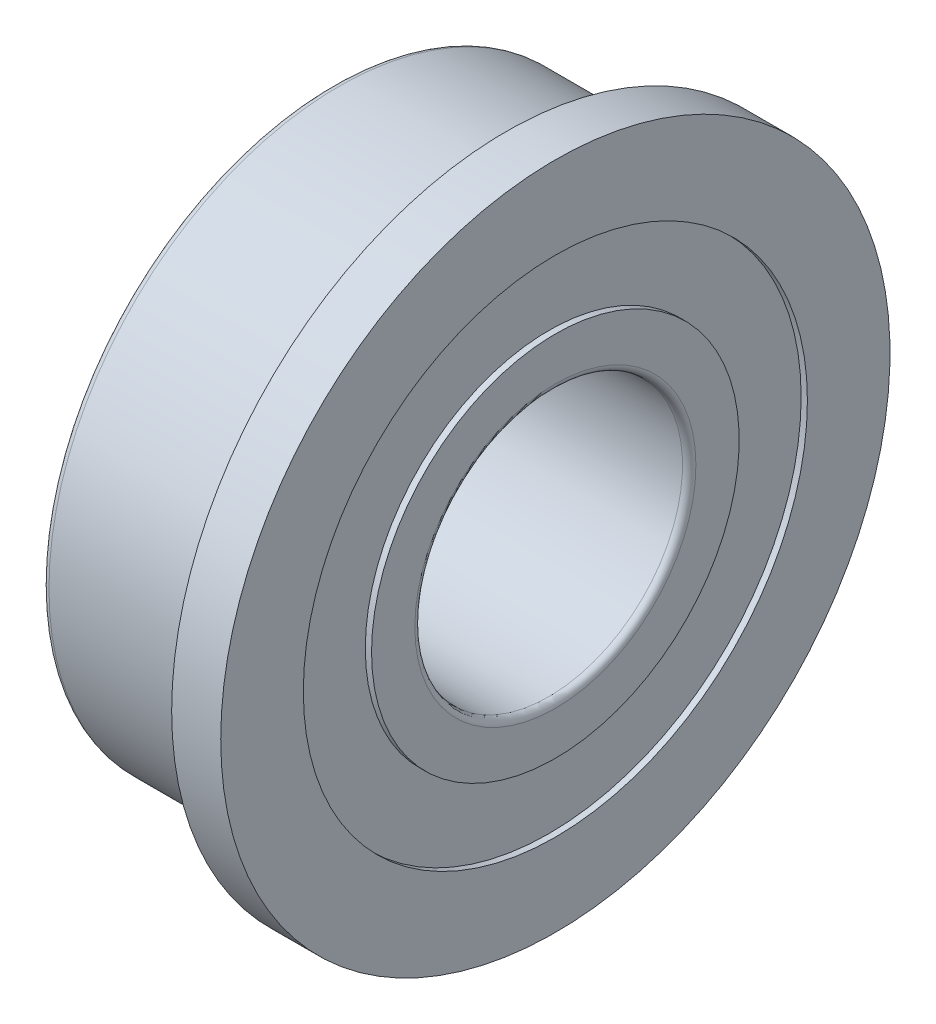
ISO-10303-21;
HEADER;
FILE_DESCRIPTION(('STEP AP214'),'2;1');
FILE_NAME('part.step','',(''),(''),'','','');
FILE_SCHEMA(('AUTOMOTIVE_DESIGN { 1 0 10303 214 1 1 1 1 }'));
ENDSEC;
DATA;
#1=APPLICATION_CONTEXT('core data for automotive mechanical design processes');
#2=APPLICATION_PROTOCOL_DEFINITION('international standard','automotive_design',2000,#1);
#3=PRODUCT_CONTEXT('',#1,'mechanical');
#4=PRODUCT('Part','Part','',(#3));
#5=PRODUCT_RELATED_PRODUCT_CATEGORY('part','',(#4));
#6=PRODUCT_DEFINITION_FORMATION('','',#4);
#7=PRODUCT_DEFINITION_CONTEXT('part definition',#1,'design');
#8=PRODUCT_DEFINITION('design','',#6,#7);
#9=PRODUCT_DEFINITION_SHAPE('','',#8);
#10=(LENGTH_UNIT() NAMED_UNIT(*) SI_UNIT(.MILLI.,.METRE.));
#11=(NAMED_UNIT(*) PLANE_ANGLE_UNIT() SI_UNIT($,.RADIAN.));
#12=(NAMED_UNIT(*) SI_UNIT($,.STERADIAN.) SOLID_ANGLE_UNIT());
#13=UNCERTAINTY_MEASURE_WITH_UNIT(LENGTH_MEASURE(1.E-05),#10,'distance_accuracy_value','');
#14=(GEOMETRIC_REPRESENTATION_CONTEXT(3) GLOBAL_UNCERTAINTY_ASSIGNED_CONTEXT((#13)) GLOBAL_UNIT_ASSIGNED_CONTEXT((#10,
#11,#12)) REPRESENTATION_CONTEXT('',''));
#15=CARTESIAN_POINT('',(0.,0.,0.));
#16=DIRECTION('',(0.,0.,1.));
#17=DIRECTION('',(1.,0.,0.));
#18=AXIS2_PLACEMENT_3D('',#15,#16,#17);
#19=CARTESIAN_POINT('',(0.,-4.12000000000003,-4.12000000000001));
#20=DIRECTION('',(-1.,0.,0.));
#21=DIRECTION('',(0.,0.,1.));
#22=AXIS2_PLACEMENT_3D('',#19,#20,#21);
#23=PLANE('',#22);
#24=CARTESIAN_POINT('',(0.,0.,0.));
#25=DIRECTION('',(-1.,0.,0.));
#26=DIRECTION('',(0.,0.,-1.));
#27=AXIS2_PLACEMENT_3D('',#24,#25,#26);
#28=CIRCLE('',#27,4.12);
#29=CARTESIAN_POINT('',(0.,0.,-4.12));
#30=VERTEX_POINT('',#29);
#31=EDGE_CURVE('E74',#30,#30,#28,.F.);
#32=ORIENTED_EDGE('',*,*,#31,.F.);
#33=EDGE_LOOP('',(#32));
#34=FACE_BOUND('',#33,.T.);
#35=CARTESIAN_POINT('',(0.,0.,0.));
#36=DIRECTION('',(1.,0.,0.));
#37=DIRECTION('',(0.,0.,1.));
#38=AXIS2_PLACEMENT_3D('',#35,#36,#37);
#39=CIRCLE('',#38,3.15);
#40=CARTESIAN_POINT('',(0.,0.,3.15));
#41=VERTEX_POINT('',#40);
#42=EDGE_CURVE('E71',#41,#41,#39,.T.);
#43=ORIENTED_EDGE('',*,*,#42,.T.);
#44=EDGE_LOOP('',(#43));
#45=FACE_BOUND('',#44,.T.);
#46=ADVANCED_FACE('F15',(#34,#45),#23,.T.);
#47=CARTESIAN_POINT('',(5.,-4.12000000000003,4.1200003159894));
#48=DIRECTION('',(1.,0.,0.));
#49=DIRECTION('',(0.,0.,-1.));
#50=AXIS2_PLACEMENT_3D('',#47,#48,#49);
#51=PLANE('',#50);
#52=CARTESIAN_POINT('',(5.,0.,0.));
#53=DIRECTION('',(1.,0.,0.));
#54=DIRECTION('',(0.,1.41914849882362E-07,0.99999999999999));
#55=AXIS2_PLACEMENT_3D('',#52,#53,#54);
#56=CIRCLE('',#55,4.12);
#57=CARTESIAN_POINT('',(5.,5.84689181515333E-07,4.11999999999996));
#58=VERTEX_POINT('',#57);
#59=EDGE_CURVE('E68',#58,#58,#56,.T.);
#60=ORIENTED_EDGE('',*,*,#59,.T.);
#61=EDGE_LOOP('',(#60));
#62=FACE_BOUND('',#61,.T.);
#63=CARTESIAN_POINT('',(5.,0.,0.));
#64=DIRECTION('',(-1.,0.,0.));
#65=DIRECTION('',(0.,0.,-1.));
#66=AXIS2_PLACEMENT_3D('',#63,#64,#65);
#67=CIRCLE('',#66,3.15);
#68=CARTESIAN_POINT('',(5.,0.,-3.15));
#69=VERTEX_POINT('',#68);
#70=EDGE_CURVE('E65',#69,#69,#67,.F.);
#71=ORIENTED_EDGE('',*,*,#70,.F.);
#72=EDGE_LOOP('',(#71));
#73=FACE_BOUND('',#72,.T.);
#74=ADVANCED_FACE('F82',(#62,#73),#51,.T.);
#75=CARTESIAN_POINT('',(4.86,-5.649,5.649));
#76=DIRECTION('',(1.,0.,0.));
#77=DIRECTION('',(0.,0.,-1.));
#78=AXIS2_PLACEMENT_3D('',#75,#76,#77);
#79=PLANE('',#78);
#80=CARTESIAN_POINT('',(4.86,0.,0.));
#81=DIRECTION('',(1.,0.,0.));
#82=DIRECTION('',(0.,-1.16839973309458E-09,1.));
#83=AXIS2_PLACEMENT_3D('',#80,#81,#82);
#84=CIRCLE('',#83,5.649);
#85=CARTESIAN_POINT('',(4.86,-6.60029009225127E-09,5.649));
#86=VERTEX_POINT('',#85);
#87=EDGE_CURVE('E62',#86,#86,#84,.T.);
#88=ORIENTED_EDGE('',*,*,#87,.T.);
#89=EDGE_LOOP('',(#88));
#90=FACE_BOUND('',#89,.T.);
#91=CARTESIAN_POINT('',(4.86,0.,0.));
#92=DIRECTION('',(-1.,0.,0.));
#93=DIRECTION('',(0.,0.,-1.));
#94=AXIS2_PLACEMENT_3D('',#91,#92,#93);
#95=CIRCLE('',#94,4.12);
#96=CARTESIAN_POINT('',(4.86,0.,-4.12));
#97=VERTEX_POINT('',#96);
#98=EDGE_CURVE('E59',#97,#97,#95,.F.);
#99=ORIENTED_EDGE('',*,*,#98,.F.);
#100=EDGE_LOOP('',(#99));
#101=FACE_BOUND('',#100,.T.);
#102=ADVANCED_FACE('F153',(#90,#101),#79,.T.);
#103=CARTESIAN_POINT('',(5.,-7.70492968244106,7.5));
#104=DIRECTION('',(1.,0.,0.));
#105=DIRECTION('',(0.,0.,-1.));
#106=AXIS2_PLACEMENT_3D('',#103,#104,#105);
#107=PLANE('',#106);
#108=CARTESIAN_POINT('',(5.,0.,0.));
#109=DIRECTION('',(1.,0.,0.));
#110=DIRECTION('',(0.,0.,1.));
#111=AXIS2_PLACEMENT_3D('',#108,#109,#110);
#112=CIRCLE('',#111,7.5);
#113=CARTESIAN_POINT('',(5.,0.,7.5));
#114=VERTEX_POINT('',#113);
#115=EDGE_CURVE('E56',#114,#114,#112,.T.);
#116=ORIENTED_EDGE('',*,*,#115,.T.);
#117=EDGE_LOOP('',(#116));
#118=FACE_BOUND('',#117,.T.);
#119=CARTESIAN_POINT('',(5.,0.,0.));
#120=DIRECTION('',(-1.,0.,0.));
#121=DIRECTION('',(0.,0.,-1.));
#122=AXIS2_PLACEMENT_3D('',#119,#120,#121);
#123=CIRCLE('',#122,5.649);
#124=CARTESIAN_POINT('',(5.,0.,-5.649));
#125=VERTEX_POINT('',#124);
#126=EDGE_CURVE('E53',#125,#125,#123,.F.);
#127=ORIENTED_EDGE('',*,*,#126,.F.);
#128=EDGE_LOOP('',(#127));
#129=FACE_BOUND('',#128,.T.);
#130=ADVANCED_FACE('F146',(#118,#129),#107,.T.);
#131=CARTESIAN_POINT('',(3.9,-7.70492968244106,-7.5));
#132=DIRECTION('',(-1.,0.,0.));
#133=DIRECTION('',(0.,0.,1.));
#134=AXIS2_PLACEMENT_3D('',#131,#132,#133);
#135=PLANE('',#134);
#136=CARTESIAN_POINT('',(3.9,0.,0.));
#137=DIRECTION('',(-1.,0.,0.));
#138=DIRECTION('',(0.,0.,-1.));
#139=AXIS2_PLACEMENT_3D('',#136,#137,#138);
#140=CIRCLE('',#139,7.5);
#141=CARTESIAN_POINT('',(3.9,0.,-7.5));
#142=VERTEX_POINT('',#141);
#143=EDGE_CURVE('E50',#142,#142,#140,.F.);
#144=ORIENTED_EDGE('',*,*,#143,.F.);
#145=EDGE_LOOP('',(#144));
#146=FACE_BOUND('',#145,.T.);
#147=CARTESIAN_POINT('',(3.9,0.,0.));
#148=DIRECTION('',(1.,0.,0.));
#149=DIRECTION('',(0.,-1.16857327490417E-09,1.));
#150=AXIS2_PLACEMENT_3D('',#147,#148,#149);
#151=CIRCLE('',#150,6.65000000000001);
#152=CARTESIAN_POINT('',(3.9,-7.77101227811273E-09,6.65000000000001));
#153=VERTEX_POINT('',#152);
#154=EDGE_CURVE('E47',#153,#153,#151,.T.);
#155=ORIENTED_EDGE('',*,*,#154,.T.);
#156=EDGE_LOOP('',(#155));
#157=FACE_BOUND('',#156,.T.);
#158=ADVANCED_FACE('F141',(#146,#157),#135,.T.);
#159=CARTESIAN_POINT('',(0.,-6.52350713113343,-6.35));
#160=DIRECTION('',(-1.,0.,0.));
#161=DIRECTION('',(0.,0.,1.));
#162=AXIS2_PLACEMENT_3D('',#159,#160,#161);
#163=PLANE('',#162);
#164=CARTESIAN_POINT('',(0.,0.,0.));
#165=DIRECTION('',(-1.,0.,0.));
#166=DIRECTION('',(0.,0.,-1.));
#167=AXIS2_PLACEMENT_3D('',#164,#165,#166);
#168=CIRCLE('',#167,6.35);
#169=CARTESIAN_POINT('',(0.,0.,-6.35));
#170=VERTEX_POINT('',#169);
#171=EDGE_CURVE('E44',#170,#170,#168,.F.);
#172=ORIENTED_EDGE('',*,*,#171,.F.);
#173=EDGE_LOOP('',(#172));
#174=FACE_BOUND('',#173,.T.);
#175=CARTESIAN_POINT('',(0.,0.,0.));
#176=DIRECTION('',(1.,0.,0.));
#177=DIRECTION('',(0.,-1.16839989032213E-09,1.));
#178=AXIS2_PLACEMENT_3D('',#175,#176,#177);
#179=CIRCLE('',#178,5.649);
#180=CARTESIAN_POINT('',(0.,-6.60029098042969E-09,5.649));
#181=VERTEX_POINT('',#180);
#182=EDGE_CURVE('E41',#181,#181,#179,.T.);
#183=ORIENTED_EDGE('',*,*,#182,.T.);
#184=EDGE_LOOP('',(#183));
#185=FACE_BOUND('',#184,.T.);
#186=ADVANCED_FACE('F100',(#174,#185),#163,.T.);
#187=CARTESIAN_POINT('',(0.14,-5.649,-5.649));
#188=DIRECTION('',(-1.,0.,0.));
#189=DIRECTION('',(0.,0.,1.));
#190=AXIS2_PLACEMENT_3D('',#187,#188,#189);
#191=PLANE('',#190);
#192=CARTESIAN_POINT('',(0.14,0.,0.));
#193=DIRECTION('',(-1.,0.,0.));
#194=DIRECTION('',(0.,0.,-1.));
#195=AXIS2_PLACEMENT_3D('',#192,#193,#194);
#196=CIRCLE('',#195,5.649);
#197=CARTESIAN_POINT('',(0.14,0.,-5.649));
#198=VERTEX_POINT('',#197);
#199=EDGE_CURVE('E38',#198,#198,#196,.F.);
#200=ORIENTED_EDGE('',*,*,#199,.F.);
#201=EDGE_LOOP('',(#200));
#202=FACE_BOUND('',#201,.T.);
#203=CARTESIAN_POINT('',(0.14,0.,0.));
#204=DIRECTION('',(1.,0.,0.));
#205=DIRECTION('',(0.,0.,1.));
#206=AXIS2_PLACEMENT_3D('',#203,#204,#205);
#207=CIRCLE('',#206,4.12);
#208=CARTESIAN_POINT('',(0.14,0.,4.12));
#209=VERTEX_POINT('',#208);
#210=EDGE_CURVE('E35',#209,#209,#207,.T.);
#211=ORIENTED_EDGE('',*,*,#210,.T.);
#212=EDGE_LOOP('',(#211));
#213=FACE_BOUND('',#212,.T.);
#214=ADVANCED_FACE('F89',(#202,#213),#191,.T.);
#215=CARTESIAN_POINT('',(0.149999999999969,0.,0.));
#216=DIRECTION('',(1.,0.,0.));
#217=DIRECTION('',(0.,0.,1.));
#218=AXIS2_PLACEMENT_3D('',#215,#216,#217);
#219=TOROIDAL_SURFACE('',#218,3.15,0.149999999999969);
#220=CARTESIAN_POINT('',(0.15,0.,0.));
#221=DIRECTION('',(1.,0.,0.));
#222=DIRECTION('',(0.,0.,1.));
#223=AXIS2_PLACEMENT_3D('',#220,#221,#222);
#224=CIRCLE('',#223,3.00000000000003);
#225=CARTESIAN_POINT('',(0.15,0.,3.00000000000003));
#226=VERTEX_POINT('',#225);
#227=EDGE_CURVE('E30',#226,#226,#224,.T.);
#228=ORIENTED_EDGE('',*,*,#227,.T.);
#229=EDGE_LOOP('',(#228));
#230=FACE_BOUND('',#229,.T.);
#231=ORIENTED_EDGE('',*,*,#42,.F.);
#232=EDGE_LOOP('',(#231));
#233=FACE_BOUND('',#232,.T.);
#234=ADVANCED_FACE('F86',(#230,#233),#219,.T.);
#235=CARTESIAN_POINT('',(13.,0.,0.));
#236=DIRECTION('',(1.,0.,0.));
#237=DIRECTION('',(0.,0.,1.));
#238=AXIS2_PLACEMENT_3D('',#235,#236,#237);
#239=CYLINDRICAL_SURFACE('',#238,3.);
#240=CARTESIAN_POINT('',(4.85,0.,0.));
#241=DIRECTION('',(1.,0.,0.));
#242=DIRECTION('',(0.,0.,1.));
#243=AXIS2_PLACEMENT_3D('',#240,#241,#242);
#244=CIRCLE('',#243,3.);
#245=CARTESIAN_POINT('',(4.85,0.,3.));
#246=VERTEX_POINT('',#245);
#247=EDGE_CURVE('E26',#246,#246,#244,.T.);
#248=ORIENTED_EDGE('',*,*,#247,.T.);
#249=EDGE_LOOP('',(#248));
#250=FACE_BOUND('',#249,.T.);
#251=ORIENTED_EDGE('',*,*,#227,.F.);
#252=EDGE_LOOP('',(#251));
#253=FACE_BOUND('',#252,.T.);
#254=ADVANCED_FACE('F88',(#250,#253),#239,.F.);
#255=CARTESIAN_POINT('',(4.85000000000006,0.,0.));
#256=DIRECTION('',(1.,0.,0.));
#257=DIRECTION('',(0.,1.4205389765632E-07,0.99999999999999));
#258=AXIS2_PLACEMENT_3D('',#255,#256,#257);
#259=TOROIDAL_SURFACE('',#258,3.14999999999994,0.149999999999938);
#260=ORIENTED_EDGE('',*,*,#70,.T.);
#261=EDGE_LOOP('',(#260));
#262=FACE_BOUND('',#261,.T.);
#263=ORIENTED_EDGE('',*,*,#247,.F.);
#264=EDGE_LOOP('',(#263));
#265=FACE_BOUND('',#264,.T.);
#266=ADVANCED_FACE('F97',(#262,#265),#259,.T.);
#267=CARTESIAN_POINT('',(13.,0.,0.));
#268=DIRECTION('',(1.,0.,0.));
#269=DIRECTION('',(0.,1.42053921637137E-07,0.99999999999999));
#270=AXIS2_PLACEMENT_3D('',#267,#268,#269);
#271=CYLINDRICAL_SURFACE('',#270,4.12);
#272=ORIENTED_EDGE('',*,*,#98,.T.);
#273=EDGE_LOOP('',(#272));
#274=FACE_BOUND('',#273,.T.);
#275=ORIENTED_EDGE('',*,*,#59,.F.);
#276=EDGE_LOOP('',(#275));
#277=FACE_BOUND('',#276,.T.);
#278=ADVANCED_FACE('F107',(#274,#277),#271,.T.);
#279=CARTESIAN_POINT('',(13.,0.,0.));
#280=DIRECTION('',(1.,0.,0.));
#281=DIRECTION('',(0.,0.,1.));
#282=AXIS2_PLACEMENT_3D('',#279,#280,#281);
#283=CYLINDRICAL_SURFACE('',#282,5.649);
#284=ORIENTED_EDGE('',*,*,#126,.T.);
#285=EDGE_LOOP('',(#284));
#286=FACE_BOUND('',#285,.T.);
#287=ORIENTED_EDGE('',*,*,#87,.F.);
#288=EDGE_LOOP('',(#287));
#289=FACE_BOUND('',#288,.T.);
#290=ADVANCED_FACE('F111',(#286,#289),#283,.F.);
#291=CARTESIAN_POINT('',(13.,0.,0.));
#292=DIRECTION('',(1.,0.,0.));
#293=DIRECTION('',(0.,0.,1.));
#294=AXIS2_PLACEMENT_3D('',#291,#292,#293);
#295=CYLINDRICAL_SURFACE('',#294,7.5);
#296=ORIENTED_EDGE('',*,*,#143,.T.);
#297=EDGE_LOOP('',(#296));
#298=FACE_BOUND('',#297,.T.);
#299=ORIENTED_EDGE('',*,*,#115,.F.);
#300=EDGE_LOOP('',(#299));
#301=FACE_BOUND('',#300,.T.);
#302=ADVANCED_FACE('F115',(#298,#301),#295,.T.);
#303=CARTESIAN_POINT('',(3.9,0.,0.));
#304=DIRECTION('',(1.,0.,0.));
#305=DIRECTION('',(0.,0.,1.));
#306=AXIS2_PLACEMENT_3D('',#303,#304,#305);
#307=TOROIDAL_SURFACE('',#306,6.5,0.150000000000011);
#308=ORIENTED_EDGE('',*,*,#154,.F.);
#309=EDGE_LOOP('',(#308));
#310=FACE_BOUND('',#309,.T.);
#311=CARTESIAN_POINT('',(3.74999999999999,0.,0.));
#312=DIRECTION('',(1.,0.,0.));
#313=DIRECTION('',(0.,0.,1.));
#314=AXIS2_PLACEMENT_3D('',#311,#312,#313);
#315=CIRCLE('',#314,6.5);
#316=CARTESIAN_POINT('',(3.74999999999999,0.,6.5));
#317=VERTEX_POINT('',#316);
#318=EDGE_CURVE('E22',#317,#317,#315,.T.);
#319=ORIENTED_EDGE('',*,*,#318,.T.);
#320=EDGE_LOOP('',(#319));
#321=FACE_BOUND('',#320,.T.);
#322=ADVANCED_FACE('F119',(#310,#321),#307,.F.);
#323=CARTESIAN_POINT('',(13.,0.,0.));
#324=DIRECTION('',(1.,0.,0.));
#325=DIRECTION('',(0.,0.,1.));
#326=AXIS2_PLACEMENT_3D('',#323,#324,#325);
#327=CYLINDRICAL_SURFACE('',#326,6.5);
#328=CARTESIAN_POINT('',(0.149999999999984,0.,0.));
#329=DIRECTION('',(1.,0.,0.));
#330=DIRECTION('',(0.,0.,1.));
#331=AXIS2_PLACEMENT_3D('',#328,#329,#330);
#332=CIRCLE('',#331,6.5);
#333=CARTESIAN_POINT('',(0.149999999999984,0.,6.5));
#334=VERTEX_POINT('',#333);
#335=EDGE_CURVE('E10',#334,#334,#332,.T.);
#336=ORIENTED_EDGE('',*,*,#335,.T.);
#337=EDGE_LOOP('',(#336));
#338=FACE_BOUND('',#337,.T.);
#339=ORIENTED_EDGE('',*,*,#318,.F.);
#340=EDGE_LOOP('',(#339));
#341=FACE_BOUND('',#340,.T.);
#342=ADVANCED_FACE('F123',(#338,#341),#327,.T.);
#343=CARTESIAN_POINT('',(0.14999999999997,0.,0.));
#344=DIRECTION('',(1.,0.,0.));
#345=DIRECTION('',(0.,0.,1.));
#346=AXIS2_PLACEMENT_3D('',#343,#344,#345);
#347=TOROIDAL_SURFACE('',#346,6.35,0.14999999999997);
#348=ORIENTED_EDGE('',*,*,#171,.T.);
#349=EDGE_LOOP('',(#348));
#350=FACE_BOUND('',#349,.T.);
#351=ORIENTED_EDGE('',*,*,#335,.F.);
#352=EDGE_LOOP('',(#351));
#353=FACE_BOUND('',#352,.T.);
#354=ADVANCED_FACE('F127',(#350,#353),#347,.T.);
#355=CARTESIAN_POINT('',(13.,0.,0.));
#356=DIRECTION('',(1.,0.,0.));
#357=DIRECTION('',(0.,0.,1.));
#358=AXIS2_PLACEMENT_3D('',#355,#356,#357);
#359=CYLINDRICAL_SURFACE('',#358,5.649);
#360=ORIENTED_EDGE('',*,*,#199,.T.);
#361=EDGE_LOOP('',(#360));
#362=FACE_BOUND('',#361,.T.);
#363=ORIENTED_EDGE('',*,*,#182,.F.);
#364=EDGE_LOOP('',(#363));
#365=FACE_BOUND('',#364,.T.);
#366=ADVANCED_FACE('F129',(#362,#365),#359,.F.);
#367=CARTESIAN_POINT('',(13.,0.,0.));
#368=DIRECTION('',(1.,0.,0.));
#369=DIRECTION('',(0.,1.42737549902245E-07,0.99999999999999));
#370=AXIS2_PLACEMENT_3D('',#367,#368,#369);
#371=CYLINDRICAL_SURFACE('',#370,4.12);
#372=ORIENTED_EDGE('',*,*,#31,.T.);
#373=EDGE_LOOP('',(#372));
#374=FACE_BOUND('',#373,.T.);
#375=ORIENTED_EDGE('',*,*,#210,.F.);
#376=EDGE_LOOP('',(#375));
#377=FACE_BOUND('',#376,.T.);
#378=ADVANCED_FACE('F17',(#374,#377),#371,.T.);
#379=CLOSED_SHELL('',(#46,#74,#102,#130,#158,#186,#214,#234,#254,#266,#278,#290,#302,#322,#342,
#354,#366,#378));
#380=MANIFOLD_SOLID_BREP('B1',#379);
#381=ADVANCED_BREP_SHAPE_REPRESENTATION('',(#18,#380),#14);
#382=SHAPE_DEFINITION_REPRESENTATION(#9,#381);
ENDSEC;
END-ISO-10303-21;
